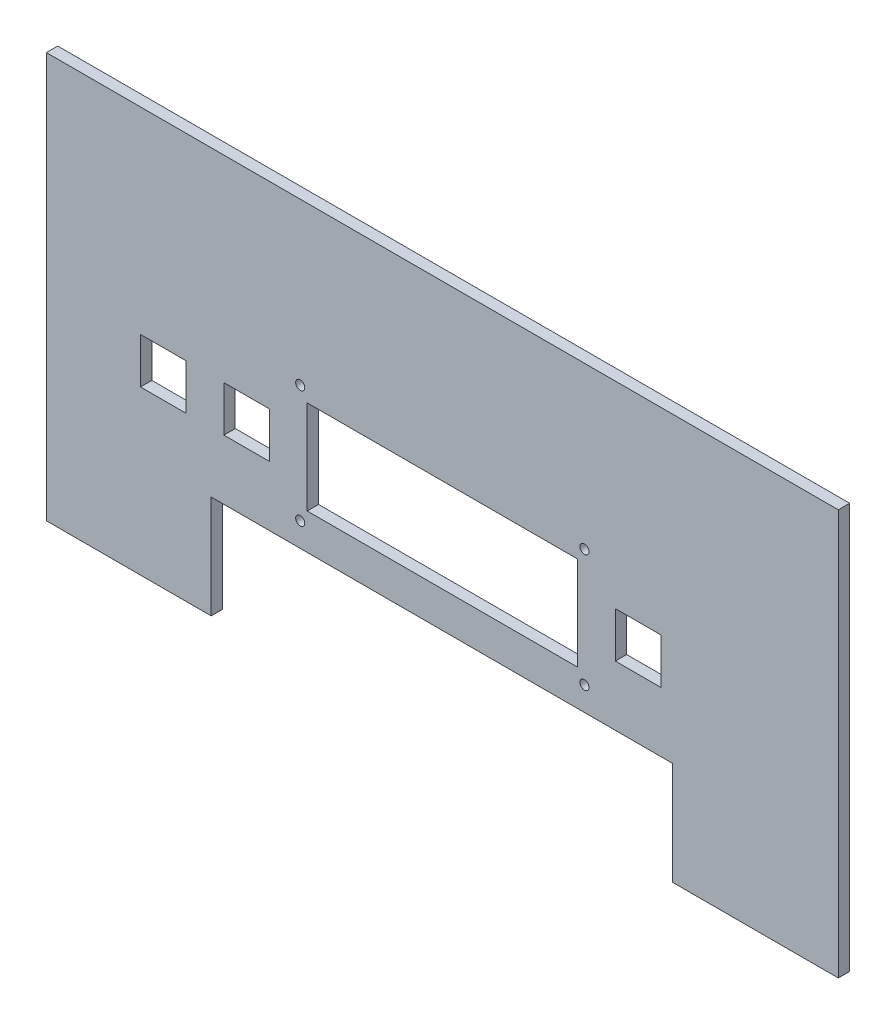
ISO-10303-21;
HEADER;
FILE_DESCRIPTION(('STEP AP214'),'2;1');
FILE_NAME('part.step','',(''),(''),'','','');
FILE_SCHEMA(('AUTOMOTIVE_DESIGN { 1 0 10303 214 1 1 1 1 }'));
ENDSEC;
DATA;
#1=APPLICATION_CONTEXT('core data for automotive mechanical design processes');
#2=APPLICATION_PROTOCOL_DEFINITION('international standard','automotive_design',2000,#1);
#3=PRODUCT_CONTEXT('',#1,'mechanical');
#4=PRODUCT('Part','Part','',(#3));
#5=PRODUCT_RELATED_PRODUCT_CATEGORY('part','',(#4));
#6=PRODUCT_DEFINITION_FORMATION('','',#4);
#7=PRODUCT_DEFINITION_CONTEXT('part definition',#1,'design');
#8=PRODUCT_DEFINITION('design','',#6,#7);
#9=PRODUCT_DEFINITION_SHAPE('','',#8);
#10=(LENGTH_UNIT() NAMED_UNIT(*) SI_UNIT(.MILLI.,.METRE.));
#11=(NAMED_UNIT(*) PLANE_ANGLE_UNIT() SI_UNIT($,.RADIAN.));
#12=(NAMED_UNIT(*) SI_UNIT($,.STERADIAN.) SOLID_ANGLE_UNIT());
#13=UNCERTAINTY_MEASURE_WITH_UNIT(LENGTH_MEASURE(1.E-05),#10,'distance_accuracy_value','');
#14=(GEOMETRIC_REPRESENTATION_CONTEXT(3) GLOBAL_UNCERTAINTY_ASSIGNED_CONTEXT((#13)) GLOBAL_UNIT_ASSIGNED_CONTEXT((#10,
#11,#12)) REPRESENTATION_CONTEXT('',''));
#15=CARTESIAN_POINT('',(0.,0.,0.));
#16=DIRECTION('',(0.,0.,1.));
#17=DIRECTION('',(1.,0.,0.));
#18=AXIS2_PLACEMENT_3D('',#15,#16,#17);
#19=CARTESIAN_POINT('',(-104.5,-53.5,3.));
#20=DIRECTION('',(0.,1.,0.));
#21=DIRECTION('',(0.,0.,1.));
#22=AXIS2_PLACEMENT_3D('',#19,#20,#21);
#23=PLANE('',#22);
#24=DIRECTION('',(1.,0.,0.));
#25=VECTOR('',#24,1.);
#26=CARTESIAN_POINT('',(-104.5,-53.5,0.));
#27=LINE('',#26,#25);
#28=CARTESIAN_POINT('',(-104.5,-53.5,0.));
#29=VERTEX_POINT('',#28);
#30=CARTESIAN_POINT('',(-60.9999999999999,-53.5,0.));
#31=VERTEX_POINT('',#30);
#32=EDGE_CURVE('E387',#29,#31,#27,.T.);
#33=ORIENTED_EDGE('',*,*,#32,.T.);
#34=DIRECTION('',(0.,0.,1.));
#35=VECTOR('',#34,1.);
#36=CARTESIAN_POINT('',(-60.9999999999999,-53.5,0.));
#37=LINE('',#36,#35);
#38=CARTESIAN_POINT('',(-60.9999999999999,-53.5,3.));
#39=VERTEX_POINT('',#38);
#40=EDGE_CURVE('E312',#31,#39,#37,.T.);
#41=ORIENTED_EDGE('',*,*,#40,.T.);
#42=DIRECTION('',(1.,0.,0.));
#43=VECTOR('',#42,1.);
#44=CARTESIAN_POINT('',(-104.5,-53.5,3.));
#45=LINE('',#44,#43);
#46=CARTESIAN_POINT('',(-104.5,-53.5,3.));
#47=VERTEX_POINT('',#46);
#48=EDGE_CURVE('E392',#47,#39,#45,.T.);
#49=ORIENTED_EDGE('',*,*,#48,.F.);
#50=DIRECTION('',(0.,0.,-1.));
#51=VECTOR('',#50,1.);
#52=CARTESIAN_POINT('',(-104.5,-53.5,3.));
#53=LINE('',#52,#51);
#54=EDGE_CURVE('E407',#47,#29,#53,.T.);
#55=ORIENTED_EDGE('',*,*,#54,.T.);
#56=EDGE_LOOP('',(#33,#41,#49,#55));
#57=FACE_BOUND('',#56,.T.);
#58=ADVANCED_FACE('F43',(#57),#23,.F.);
#59=CARTESIAN_POINT('',(0.,0.,3.));
#60=DIRECTION('',(0.,0.,-1.));
#61=DIRECTION('',(-1.,0.,0.));
#62=AXIS2_PLACEMENT_3D('',#59,#60,#61);
#63=PLANE('',#62);
#64=DIRECTION('',(-1.,0.,0.));
#65=VECTOR('',#64,1.);
#66=CARTESIAN_POINT('',(45.65,1.5,3.));
#67=LINE('',#66,#65);
#68=CARTESIAN_POINT('',(57.65,1.5,3.));
#69=VERTEX_POINT('',#68);
#70=CARTESIAN_POINT('',(45.65,1.5,3.));
#71=VERTEX_POINT('',#70);
#72=EDGE_CURVE('E258',#69,#71,#67,.T.);
#73=ORIENTED_EDGE('',*,*,#72,.F.);
#74=DIRECTION('',(0.,1.,0.));
#75=VECTOR('',#74,1.);
#76=CARTESIAN_POINT('',(57.65,-10.5,3.));
#77=LINE('',#76,#75);
#78=CARTESIAN_POINT('',(57.65,-10.5,3.));
#79=VERTEX_POINT('',#78);
#80=EDGE_CURVE('E58',#79,#69,#77,.T.);
#81=ORIENTED_EDGE('',*,*,#80,.F.);
#82=DIRECTION('',(1.,0.,0.));
#83=VECTOR('',#82,1.);
#84=CARTESIAN_POINT('',(45.65,-10.5,3.));
#85=LINE('',#84,#83);
#86=CARTESIAN_POINT('',(45.65,-10.5,3.));
#87=VERTEX_POINT('',#86);
#88=EDGE_CURVE('E251',#87,#79,#85,.T.);
#89=ORIENTED_EDGE('',*,*,#88,.F.);
#90=DIRECTION('',(0.,-1.,0.));
#91=VECTOR('',#90,1.);
#92=CARTESIAN_POINT('',(45.65,-10.5,3.));
#93=LINE('',#92,#91);
#94=EDGE_CURVE('E254',#71,#87,#93,.T.);
#95=ORIENTED_EDGE('',*,*,#94,.F.);
#96=EDGE_LOOP('',(#73,#81,#89,#95));
#97=FACE_BOUND('',#96,.T.);
#98=DIRECTION('',(-1.,0.,0.));
#99=VECTOR('',#98,1.);
#100=CARTESIAN_POINT('',(-79.65,1.5,3.));
#101=LINE('',#100,#99);
#102=CARTESIAN_POINT('',(-67.65,1.5,3.));
#103=VERTEX_POINT('',#102);
#104=CARTESIAN_POINT('',(-79.65,1.5,3.));
#105=VERTEX_POINT('',#104);
#106=EDGE_CURVE('E224',#103,#105,#101,.T.);
#107=ORIENTED_EDGE('',*,*,#106,.F.);
#108=DIRECTION('',(0.,1.,0.));
#109=VECTOR('',#108,1.);
#110=CARTESIAN_POINT('',(-67.65,-10.5,3.));
#111=LINE('',#110,#109);
#112=CARTESIAN_POINT('',(-67.65,-10.5,3.));
#113=VERTEX_POINT('',#112);
#114=EDGE_CURVE('E66',#113,#103,#111,.T.);
#115=ORIENTED_EDGE('',*,*,#114,.F.);
#116=DIRECTION('',(1.,0.,0.));
#117=VECTOR('',#116,1.);
#118=CARTESIAN_POINT('',(-79.65,-10.5,3.));
#119=LINE('',#118,#117);
#120=CARTESIAN_POINT('',(-79.65,-10.5,3.));
#121=VERTEX_POINT('',#120);
#122=EDGE_CURVE('E213',#121,#113,#119,.T.);
#123=ORIENTED_EDGE('',*,*,#122,.F.);
#124=DIRECTION('',(0.,-1.,0.));
#125=VECTOR('',#124,1.);
#126=CARTESIAN_POINT('',(-79.65,-10.5,3.));
#127=LINE('',#126,#125);
#128=EDGE_CURVE('E218',#105,#121,#127,.T.);
#129=ORIENTED_EDGE('',*,*,#128,.F.);
#130=EDGE_LOOP('',(#107,#115,#123,#129));
#131=FACE_BOUND('',#130,.T.);
#132=DIRECTION('',(-1.,0.,0.));
#133=VECTOR('',#132,1.);
#134=CARTESIAN_POINT('',(-57.65,1.5,3.));
#135=LINE('',#134,#133);
#136=CARTESIAN_POINT('',(-45.65,1.5,3.));
#137=VERTEX_POINT('',#136);
#138=CARTESIAN_POINT('',(-57.65,1.5,3.));
#139=VERTEX_POINT('',#138);
#140=EDGE_CURVE('E227',#137,#139,#135,.T.);
#141=ORIENTED_EDGE('',*,*,#140,.F.);
#142=DIRECTION('',(0.,1.,0.));
#143=VECTOR('',#142,1.);
#144=CARTESIAN_POINT('',(-45.65,-10.5,3.));
#145=LINE('',#144,#143);
#146=CARTESIAN_POINT('',(-45.65,-10.5,3.));
#147=VERTEX_POINT('',#146);
#148=EDGE_CURVE('E225',#147,#137,#145,.T.);
#149=ORIENTED_EDGE('',*,*,#148,.F.);
#150=DIRECTION('',(1.,0.,0.));
#151=VECTOR('',#150,1.);
#152=CARTESIAN_POINT('',(-57.65,-10.5,3.));
#153=LINE('',#152,#151);
#154=CARTESIAN_POINT('',(-57.65,-10.5,3.));
#155=VERTEX_POINT('',#154);
#156=EDGE_CURVE('E276',#155,#147,#153,.T.);
#157=ORIENTED_EDGE('',*,*,#156,.F.);
#158=DIRECTION('',(0.,-1.,0.));
#159=VECTOR('',#158,1.);
#160=CARTESIAN_POINT('',(-57.65,-10.5,3.));
#161=LINE('',#160,#159);
#162=EDGE_CURVE('E288',#139,#155,#161,.T.);
#163=ORIENTED_EDGE('',*,*,#162,.F.);
#164=EDGE_LOOP('',(#141,#149,#157,#163));
#165=FACE_BOUND('',#164,.T.);
#166=ORIENTED_EDGE('',*,*,#48,.T.);
#167=DIRECTION('',(0.,-1.,0.));
#168=VECTOR('',#167,1.);
#169=CARTESIAN_POINT('',(-61.0000000000004,-26.3199999999999,3.));
#170=LINE('',#169,#168);
#171=CARTESIAN_POINT('',(-61.0000000000004,-26.3199999999999,3.));
#172=VERTEX_POINT('',#171);
#173=EDGE_CURVE('E295',#172,#39,#170,.T.);
#174=ORIENTED_EDGE('',*,*,#173,.F.);
#175=DIRECTION('',(-1.,0.,0.));
#176=VECTOR('',#175,1.);
#177=CARTESIAN_POINT('',(-61.0000000000004,-26.3199999999999,3.));
#178=LINE('',#177,#176);
#179=CARTESIAN_POINT('',(60.7047396104666,-26.3199999999999,3.));
#180=VERTEX_POINT('',#179);
#181=EDGE_CURVE('E306',#180,#172,#178,.T.);
#182=ORIENTED_EDGE('',*,*,#181,.F.);
#183=DIRECTION('',(0.,1.,0.));
#184=VECTOR('',#183,1.);
#185=CARTESIAN_POINT('',(60.7047396104666,-26.3199999999999,3.));
#186=LINE('',#185,#184);
#187=CARTESIAN_POINT('',(60.7047396104666,-53.5,3.));
#188=VERTEX_POINT('',#187);
#189=EDGE_CURVE('E314',#188,#180,#186,.T.);
#190=ORIENTED_EDGE('',*,*,#189,.F.);
#191=CARTESIAN_POINT('',(104.5,-53.5,3.));
#192=VERTEX_POINT('',#191);
#193=EDGE_CURVE('E391',#188,#192,#45,.T.);
#194=ORIENTED_EDGE('',*,*,#193,.T.);
#195=DIRECTION('',(0.,1.,0.));
#196=VECTOR('',#195,1.);
#197=CARTESIAN_POINT('',(104.5,-53.5,3.));
#198=LINE('',#197,#196);
#199=CARTESIAN_POINT('',(104.5,53.5,3.));
#200=VERTEX_POINT('',#199);
#201=EDGE_CURVE('E383',#192,#200,#198,.T.);
#202=ORIENTED_EDGE('',*,*,#201,.T.);
#203=DIRECTION('',(-1.,0.,0.));
#204=VECTOR('',#203,1.);
#205=CARTESIAN_POINT('',(-104.5,53.5,3.));
#206=LINE('',#205,#204);
#207=CARTESIAN_POINT('',(-104.5,53.5,3.));
#208=VERTEX_POINT('',#207);
#209=EDGE_CURVE('E386',#200,#208,#206,.T.);
#210=ORIENTED_EDGE('',*,*,#209,.T.);
#211=DIRECTION('',(0.,-1.,0.));
#212=VECTOR('',#211,1.);
#213=CARTESIAN_POINT('',(-104.5,-53.5,3.));
#214=LINE('',#213,#212);
#215=EDGE_CURVE('E389',#208,#47,#214,.T.);
#216=ORIENTED_EDGE('',*,*,#215,.T.);
#217=EDGE_LOOP('',(#166,#174,#182,#190,#194,#202,#210,#216));
#218=FACE_BOUND('',#217,.T.);
#219=DIRECTION('',(0.,-1.,0.));
#220=VECTOR('',#219,1.);
#221=CARTESIAN_POINT('',(-35.65,7.85,3.));
#222=LINE('',#221,#220);
#223=CARTESIAN_POINT('',(-35.65,7.85,3.));
#224=VERTEX_POINT('',#223);
#225=CARTESIAN_POINT('',(-35.65,-16.85,3.));
#226=VERTEX_POINT('',#225);
#227=EDGE_CURVE('E352',#224,#226,#222,.T.);
#228=ORIENTED_EDGE('',*,*,#227,.F.);
#229=DIRECTION('',(-1.,0.,0.));
#230=VECTOR('',#229,1.);
#231=CARTESIAN_POINT('',(-35.65,7.85,3.));
#232=LINE('',#231,#230);
#233=CARTESIAN_POINT('',(35.65,7.85,3.));
#234=VERTEX_POINT('',#233);
#235=EDGE_CURVE('E360',#234,#224,#232,.T.);
#236=ORIENTED_EDGE('',*,*,#235,.F.);
#237=DIRECTION('',(0.,1.,0.));
#238=VECTOR('',#237,1.);
#239=CARTESIAN_POINT('',(35.65,7.85,3.));
#240=LINE('',#239,#238);
#241=CARTESIAN_POINT('',(35.65,-16.85,3.));
#242=VERTEX_POINT('',#241);
#243=EDGE_CURVE('E357',#242,#234,#240,.T.);
#244=ORIENTED_EDGE('',*,*,#243,.F.);
#245=DIRECTION('',(1.,0.,0.));
#246=VECTOR('',#245,1.);
#247=CARTESIAN_POINT('',(-35.65,-16.85,3.));
#248=LINE('',#247,#246);
#249=EDGE_CURVE('E354',#226,#242,#248,.T.);
#250=ORIENTED_EDGE('',*,*,#249,.F.);
#251=EDGE_LOOP('',(#228,#236,#244,#250));
#252=FACE_BOUND('',#251,.T.);
#253=CARTESIAN_POINT('',(-37.5,11.,3.));
#254=DIRECTION('',(0.,0.,1.));
#255=DIRECTION('',(1.,0.,0.));
#256=AXIS2_PLACEMENT_3D('',#253,#254,#255);
#257=CIRCLE('',#256,1.2);
#258=CARTESIAN_POINT('',(-36.3,11.,3.));
#259=VERTEX_POINT('',#258);
#260=EDGE_CURVE('E346',#259,#259,#257,.T.);
#261=ORIENTED_EDGE('',*,*,#260,.F.);
#262=EDGE_LOOP('',(#261));
#263=FACE_BOUND('',#262,.T.);
#264=CARTESIAN_POINT('',(37.5,11.,3.));
#265=DIRECTION('',(0.,0.,1.));
#266=DIRECTION('',(-1.,0.,0.));
#267=AXIS2_PLACEMENT_3D('',#264,#265,#266);
#268=CIRCLE('',#267,1.2);
#269=CARTESIAN_POINT('',(36.3,11.,3.));
#270=VERTEX_POINT('',#269);
#271=EDGE_CURVE('E340',#270,#270,#268,.T.);
#272=ORIENTED_EDGE('',*,*,#271,.F.);
#273=EDGE_LOOP('',(#272));
#274=FACE_BOUND('',#273,.T.);
#275=CARTESIAN_POINT('',(37.5,-20.,3.));
#276=DIRECTION('',(0.,0.,1.));
#277=DIRECTION('',(1.,0.,0.));
#278=AXIS2_PLACEMENT_3D('',#275,#276,#277);
#279=CIRCLE('',#278,1.2);
#280=CARTESIAN_POINT('',(38.7,-20.,3.));
#281=VERTEX_POINT('',#280);
#282=EDGE_CURVE('E334',#281,#281,#279,.T.);
#283=ORIENTED_EDGE('',*,*,#282,.F.);
#284=EDGE_LOOP('',(#283));
#285=FACE_BOUND('',#284,.T.);
#286=CARTESIAN_POINT('',(-37.5,-20.,3.));
#287=DIRECTION('',(0.,0.,1.));
#288=DIRECTION('',(-1.,0.,0.));
#289=AXIS2_PLACEMENT_3D('',#286,#287,#288);
#290=CIRCLE('',#289,1.2);
#291=CARTESIAN_POINT('',(-38.7,-20.,3.));
#292=VERTEX_POINT('',#291);
#293=EDGE_CURVE('E328',#292,#292,#290,.T.);
#294=ORIENTED_EDGE('',*,*,#293,.F.);
#295=EDGE_LOOP('',(#294));
#296=FACE_BOUND('',#295,.T.);
#297=ADVANCED_FACE('F221',(#97,#131,#165,#218,#252,#263,#274,#285,#296),#63,.F.);
#298=CARTESIAN_POINT('',(0.,0.,0.));
#299=DIRECTION('',(0.,0.,-1.));
#300=DIRECTION('',(-1.,0.,0.));
#301=AXIS2_PLACEMENT_3D('',#298,#299,#300);
#302=PLANE('',#301);
#303=DIRECTION('',(0.,1.,0.));
#304=VECTOR('',#303,1.);
#305=CARTESIAN_POINT('',(57.65,-10.5,0.));
#306=LINE('',#305,#304);
#307=CARTESIAN_POINT('',(57.65,-10.5,0.));
#308=VERTEX_POINT('',#307);
#309=CARTESIAN_POINT('',(57.65,1.5,0.));
#310=VERTEX_POINT('',#309);
#311=EDGE_CURVE('E255',#308,#310,#306,.T.);
#312=ORIENTED_EDGE('',*,*,#311,.T.);
#313=DIRECTION('',(-1.,0.,0.));
#314=VECTOR('',#313,1.);
#315=CARTESIAN_POINT('',(45.65,1.5,0.));
#316=LINE('',#315,#314);
#317=CARTESIAN_POINT('',(45.65,1.5,0.));
#318=VERTEX_POINT('',#317);
#319=EDGE_CURVE('E267',#310,#318,#316,.T.);
#320=ORIENTED_EDGE('',*,*,#319,.T.);
#321=DIRECTION('',(0.,-1.,0.));
#322=VECTOR('',#321,1.);
#323=CARTESIAN_POINT('',(45.65,-10.5,0.));
#324=LINE('',#323,#322);
#325=CARTESIAN_POINT('',(45.65,-10.5,0.));
#326=VERTEX_POINT('',#325);
#327=EDGE_CURVE('E264',#318,#326,#324,.T.);
#328=ORIENTED_EDGE('',*,*,#327,.T.);
#329=DIRECTION('',(1.,0.,0.));
#330=VECTOR('',#329,1.);
#331=CARTESIAN_POINT('',(45.65,-10.5,0.));
#332=LINE('',#331,#330);
#333=EDGE_CURVE('E244',#326,#308,#332,.T.);
#334=ORIENTED_EDGE('',*,*,#333,.T.);
#335=EDGE_LOOP('',(#312,#320,#328,#334));
#336=FACE_BOUND('',#335,.T.);
#337=DIRECTION('',(0.,1.,0.));
#338=VECTOR('',#337,1.);
#339=CARTESIAN_POINT('',(-67.65,-10.5,0.));
#340=LINE('',#339,#338);
#341=CARTESIAN_POINT('',(-67.65,-10.5,0.));
#342=VERTEX_POINT('',#341);
#343=CARTESIAN_POINT('',(-67.65,1.5,0.));
#344=VERTEX_POINT('',#343);
#345=EDGE_CURVE('E206',#342,#344,#340,.T.);
#346=ORIENTED_EDGE('',*,*,#345,.T.);
#347=DIRECTION('',(-1.,0.,0.));
#348=VECTOR('',#347,1.);
#349=CARTESIAN_POINT('',(-79.65,1.5,0.));
#350=LINE('',#349,#348);
#351=CARTESIAN_POINT('',(-79.65,1.5,0.));
#352=VERTEX_POINT('',#351);
#353=EDGE_CURVE('E238',#344,#352,#350,.T.);
#354=ORIENTED_EDGE('',*,*,#353,.T.);
#355=DIRECTION('',(0.,-1.,0.));
#356=VECTOR('',#355,1.);
#357=CARTESIAN_POINT('',(-79.65,-10.5,0.));
#358=LINE('',#357,#356);
#359=CARTESIAN_POINT('',(-79.65,-10.5,0.));
#360=VERTEX_POINT('',#359);
#361=EDGE_CURVE('E234',#352,#360,#358,.T.);
#362=ORIENTED_EDGE('',*,*,#361,.T.);
#363=DIRECTION('',(1.,0.,0.));
#364=VECTOR('',#363,1.);
#365=CARTESIAN_POINT('',(-79.65,-10.5,0.));
#366=LINE('',#365,#364);
#367=EDGE_CURVE('E232',#360,#342,#366,.T.);
#368=ORIENTED_EDGE('',*,*,#367,.T.);
#369=EDGE_LOOP('',(#346,#354,#362,#368));
#370=FACE_BOUND('',#369,.T.);
#371=DIRECTION('',(0.,1.,0.));
#372=VECTOR('',#371,1.);
#373=CARTESIAN_POINT('',(-45.65,-10.5,0.));
#374=LINE('',#373,#372);
#375=CARTESIAN_POINT('',(-45.65,-10.5,0.));
#376=VERTEX_POINT('',#375);
#377=CARTESIAN_POINT('',(-45.65,1.5,0.));
#378=VERTEX_POINT('',#377);
#379=EDGE_CURVE('E272',#376,#378,#374,.T.);
#380=ORIENTED_EDGE('',*,*,#379,.T.);
#381=DIRECTION('',(-1.,0.,0.));
#382=VECTOR('',#381,1.);
#383=CARTESIAN_POINT('',(-57.65,1.5,0.));
#384=LINE('',#383,#382);
#385=CARTESIAN_POINT('',(-57.65,1.5,0.));
#386=VERTEX_POINT('',#385);
#387=EDGE_CURVE('E275',#378,#386,#384,.T.);
#388=ORIENTED_EDGE('',*,*,#387,.T.);
#389=DIRECTION('',(0.,-1.,0.));
#390=VECTOR('',#389,1.);
#391=CARTESIAN_POINT('',(-57.65,-10.5,0.));
#392=LINE('',#391,#390);
#393=CARTESIAN_POINT('',(-57.65,-10.5,0.));
#394=VERTEX_POINT('',#393);
#395=EDGE_CURVE('E279',#386,#394,#392,.T.);
#396=ORIENTED_EDGE('',*,*,#395,.T.);
#397=DIRECTION('',(1.,0.,0.));
#398=VECTOR('',#397,1.);
#399=CARTESIAN_POINT('',(-57.65,-10.5,0.));
#400=LINE('',#399,#398);
#401=EDGE_CURVE('E282',#394,#376,#400,.T.);
#402=ORIENTED_EDGE('',*,*,#401,.T.);
#403=EDGE_LOOP('',(#380,#388,#396,#402));
#404=FACE_BOUND('',#403,.T.);
#405=DIRECTION('',(0.,-1.,0.));
#406=VECTOR('',#405,1.);
#407=CARTESIAN_POINT('',(-61.0000000000004,-26.3199999999999,0.));
#408=LINE('',#407,#406);
#409=CARTESIAN_POINT('',(-61.0000000000004,-26.3199999999999,0.));
#410=VERTEX_POINT('',#409);
#411=EDGE_CURVE('E302',#410,#31,#408,.T.);
#412=ORIENTED_EDGE('',*,*,#411,.T.);
#413=ORIENTED_EDGE('',*,*,#32,.F.);
#414=DIRECTION('',(0.,-1.,0.));
#415=VECTOR('',#414,1.);
#416=CARTESIAN_POINT('',(-104.5,-53.5,0.));
#417=LINE('',#416,#415);
#418=CARTESIAN_POINT('',(-104.5,53.5,0.));
#419=VERTEX_POINT('',#418);
#420=EDGE_CURVE('E400',#419,#29,#417,.T.);
#421=ORIENTED_EDGE('',*,*,#420,.F.);
#422=DIRECTION('',(-1.,0.,0.));
#423=VECTOR('',#422,1.);
#424=CARTESIAN_POINT('',(-104.5,53.5,0.));
#425=LINE('',#424,#423);
#426=CARTESIAN_POINT('',(104.5,53.5,0.));
#427=VERTEX_POINT('',#426);
#428=EDGE_CURVE('E398',#427,#419,#425,.T.);
#429=ORIENTED_EDGE('',*,*,#428,.F.);
#430=DIRECTION('',(0.,1.,0.));
#431=VECTOR('',#430,1.);
#432=CARTESIAN_POINT('',(104.5,-53.5,0.));
#433=LINE('',#432,#431);
#434=CARTESIAN_POINT('',(104.5,-53.5,0.));
#435=VERTEX_POINT('',#434);
#436=EDGE_CURVE('E382',#435,#427,#433,.T.);
#437=ORIENTED_EDGE('',*,*,#436,.F.);
#438=CARTESIAN_POINT('',(60.7047396104666,-53.5,0.));
#439=VERTEX_POINT('',#438);
#440=EDGE_CURVE('E402',#439,#435,#27,.T.);
#441=ORIENTED_EDGE('',*,*,#440,.F.);
#442=DIRECTION('',(0.,1.,0.));
#443=VECTOR('',#442,1.);
#444=CARTESIAN_POINT('',(60.7047396104666,-26.3199999999999,0.));
#445=LINE('',#444,#443);
#446=CARTESIAN_POINT('',(60.7047396104666,-26.3199999999999,0.));
#447=VERTEX_POINT('',#446);
#448=EDGE_CURVE('E305',#439,#447,#445,.T.);
#449=ORIENTED_EDGE('',*,*,#448,.T.);
#450=DIRECTION('',(-1.,0.,0.));
#451=VECTOR('',#450,1.);
#452=CARTESIAN_POINT('',(-61.0000000000004,-26.3199999999999,0.));
#453=LINE('',#452,#451);
#454=EDGE_CURVE('E309',#447,#410,#453,.T.);
#455=ORIENTED_EDGE('',*,*,#454,.T.);
#456=EDGE_LOOP('',(#412,#413,#421,#429,#437,#441,#449,#455));
#457=FACE_BOUND('',#456,.T.);
#458=CARTESIAN_POINT('',(37.5,-20.,0.));
#459=DIRECTION('',(0.,0.,1.));
#460=DIRECTION('',(1.,0.,0.));
#461=AXIS2_PLACEMENT_3D('',#458,#459,#460);
#462=CIRCLE('',#461,1.2);
#463=CARTESIAN_POINT('',(38.7,-20.,0.));
#464=VERTEX_POINT('',#463);
#465=EDGE_CURVE('E331',#464,#464,#462,.T.);
#466=ORIENTED_EDGE('',*,*,#465,.T.);
#467=EDGE_LOOP('',(#466));
#468=FACE_BOUND('',#467,.T.);
#469=CARTESIAN_POINT('',(-37.5,11.,0.));
#470=DIRECTION('',(0.,0.,1.));
#471=DIRECTION('',(1.,0.,0.));
#472=AXIS2_PLACEMENT_3D('',#469,#470,#471);
#473=CIRCLE('',#472,1.2);
#474=CARTESIAN_POINT('',(-36.3,11.,0.));
#475=VERTEX_POINT('',#474);
#476=EDGE_CURVE('E343',#475,#475,#473,.T.);
#477=ORIENTED_EDGE('',*,*,#476,.T.);
#478=EDGE_LOOP('',(#477));
#479=FACE_BOUND('',#478,.T.);
#480=DIRECTION('',(-1.,0.,0.));
#481=VECTOR('',#480,1.);
#482=CARTESIAN_POINT('',(-35.65,7.85,0.));
#483=LINE('',#482,#481);
#484=CARTESIAN_POINT('',(35.65,7.85,0.));
#485=VERTEX_POINT('',#484);
#486=CARTESIAN_POINT('',(-35.65,7.85,0.));
#487=VERTEX_POINT('',#486);
#488=EDGE_CURVE('E355',#485,#487,#483,.T.);
#489=ORIENTED_EDGE('',*,*,#488,.T.);
#490=DIRECTION('',(0.,-1.,0.));
#491=VECTOR('',#490,1.);
#492=CARTESIAN_POINT('',(-35.65,7.85,0.));
#493=LINE('',#492,#491);
#494=CARTESIAN_POINT('',(-35.65,-16.85,0.));
#495=VERTEX_POINT('',#494);
#496=EDGE_CURVE('E349',#487,#495,#493,.T.);
#497=ORIENTED_EDGE('',*,*,#496,.T.);
#498=DIRECTION('',(1.,0.,0.));
#499=VECTOR('',#498,1.);
#500=CARTESIAN_POINT('',(-35.65,-16.85,0.));
#501=LINE('',#500,#499);
#502=CARTESIAN_POINT('',(35.65,-16.85,0.));
#503=VERTEX_POINT('',#502);
#504=EDGE_CURVE('E365',#495,#503,#501,.T.);
#505=ORIENTED_EDGE('',*,*,#504,.T.);
#506=DIRECTION('',(0.,1.,0.));
#507=VECTOR('',#506,1.);
#508=CARTESIAN_POINT('',(35.65,7.85,0.));
#509=LINE('',#508,#507);
#510=EDGE_CURVE('E368',#503,#485,#509,.T.);
#511=ORIENTED_EDGE('',*,*,#510,.T.);
#512=EDGE_LOOP('',(#489,#497,#505,#511));
#513=FACE_BOUND('',#512,.T.);
#514=CARTESIAN_POINT('',(37.5,11.,0.));
#515=DIRECTION('',(0.,0.,1.));
#516=DIRECTION('',(-1.,0.,0.));
#517=AXIS2_PLACEMENT_3D('',#514,#515,#516);
#518=CIRCLE('',#517,1.2);
#519=CARTESIAN_POINT('',(36.3,11.,0.));
#520=VERTEX_POINT('',#519);
#521=EDGE_CURVE('E337',#520,#520,#518,.T.);
#522=ORIENTED_EDGE('',*,*,#521,.T.);
#523=EDGE_LOOP('',(#522));
#524=FACE_BOUND('',#523,.T.);
#525=CARTESIAN_POINT('',(-37.5,-20.,0.));
#526=DIRECTION('',(0.,0.,1.));
#527=DIRECTION('',(-1.,0.,0.));
#528=AXIS2_PLACEMENT_3D('',#525,#526,#527);
#529=CIRCLE('',#528,1.2);
#530=CARTESIAN_POINT('',(-38.7,-20.,0.));
#531=VERTEX_POINT('',#530);
#532=EDGE_CURVE('E321',#531,#531,#529,.T.);
#533=ORIENTED_EDGE('',*,*,#532,.T.);
#534=EDGE_LOOP('',(#533));
#535=FACE_BOUND('',#534,.T.);
#536=ADVANCED_FACE('F419',(#336,#370,#404,#457,#468,#479,#513,#524,#535),#302,.T.);
#537=CARTESIAN_POINT('',(104.5,-53.5,3.));
#538=DIRECTION('',(-1.,0.,0.));
#539=DIRECTION('',(0.,0.,1.));
#540=AXIS2_PLACEMENT_3D('',#537,#538,#539);
#541=PLANE('',#540);
#542=ORIENTED_EDGE('',*,*,#436,.T.);
#543=DIRECTION('',(0.,0.,-1.));
#544=VECTOR('',#543,1.);
#545=CARTESIAN_POINT('',(104.5,53.5,3.));
#546=LINE('',#545,#544);
#547=EDGE_CURVE('E11',#200,#427,#546,.T.);
#548=ORIENTED_EDGE('',*,*,#547,.F.);
#549=ORIENTED_EDGE('',*,*,#201,.F.);
#550=DIRECTION('',(0.,0.,-1.));
#551=VECTOR('',#550,1.);
#552=CARTESIAN_POINT('',(104.5,-53.5,3.));
#553=LINE('',#552,#551);
#554=EDGE_CURVE('E395',#192,#435,#553,.T.);
#555=ORIENTED_EDGE('',*,*,#554,.T.);
#556=EDGE_LOOP('',(#542,#548,#549,#555));
#557=FACE_BOUND('',#556,.T.);
#558=ADVANCED_FACE('F45',(#557),#541,.F.);
#559=CARTESIAN_POINT('',(-104.5,53.5,3.));
#560=DIRECTION('',(0.,-1.,0.));
#561=DIRECTION('',(1.,0.,0.));
#562=AXIS2_PLACEMENT_3D('',#559,#560,#561);
#563=PLANE('',#562);
#564=ORIENTED_EDGE('',*,*,#428,.T.);
#565=DIRECTION('',(0.,0.,-1.));
#566=VECTOR('',#565,1.);
#567=CARTESIAN_POINT('',(-104.5,53.5,3.));
#568=LINE('',#567,#566);
#569=EDGE_CURVE('E51',#208,#419,#568,.T.);
#570=ORIENTED_EDGE('',*,*,#569,.F.);
#571=ORIENTED_EDGE('',*,*,#209,.F.);
#572=ORIENTED_EDGE('',*,*,#547,.T.);
#573=EDGE_LOOP('',(#564,#570,#571,#572));
#574=FACE_BOUND('',#573,.T.);
#575=ADVANCED_FACE('F431',(#574),#563,.F.);
#576=CARTESIAN_POINT('',(-104.5,-53.5,3.));
#577=DIRECTION('',(1.,0.,0.));
#578=DIRECTION('',(0.,0.,-1.));
#579=AXIS2_PLACEMENT_3D('',#576,#577,#578);
#580=PLANE('',#579);
#581=ORIENTED_EDGE('',*,*,#420,.T.);
#582=ORIENTED_EDGE('',*,*,#54,.F.);
#583=ORIENTED_EDGE('',*,*,#215,.F.);
#584=ORIENTED_EDGE('',*,*,#569,.T.);
#585=EDGE_LOOP('',(#581,#582,#583,#584));
#586=FACE_BOUND('',#585,.T.);
#587=ADVANCED_FACE('F414',(#586),#580,.F.);
#588=ORIENTED_EDGE('',*,*,#193,.F.);
#589=DIRECTION('',(0.,0.,1.));
#590=VECTOR('',#589,1.);
#591=CARTESIAN_POINT('',(60.7047396104666,-53.5,0.));
#592=LINE('',#591,#590);
#593=EDGE_CURVE('E324',#439,#188,#592,.T.);
#594=ORIENTED_EDGE('',*,*,#593,.F.);
#595=ORIENTED_EDGE('',*,*,#440,.T.);
#596=ORIENTED_EDGE('',*,*,#554,.F.);
#597=EDGE_LOOP('',(#588,#594,#595,#596));
#598=FACE_BOUND('',#597,.T.);
#599=ADVANCED_FACE('F438',(#598),#23,.F.);
#600=CARTESIAN_POINT('',(-35.65,7.85,3.));
#601=DIRECTION('',(1.,0.,0.));
#602=DIRECTION('',(0.,0.,-1.));
#603=AXIS2_PLACEMENT_3D('',#600,#601,#602);
#604=PLANE('',#603);
#605=ORIENTED_EDGE('',*,*,#496,.F.);
#606=DIRECTION('',(0.,0.,-1.));
#607=VECTOR('',#606,1.);
#608=CARTESIAN_POINT('',(-35.65,7.85,3.));
#609=LINE('',#608,#607);
#610=EDGE_CURVE('E362',#224,#487,#609,.T.);
#611=ORIENTED_EDGE('',*,*,#610,.F.);
#612=ORIENTED_EDGE('',*,*,#227,.T.);
#613=DIRECTION('',(0.,0.,-1.));
#614=VECTOR('',#613,1.);
#615=CARTESIAN_POINT('',(-35.65,-16.85,3.));
#616=LINE('',#615,#614);
#617=EDGE_CURVE('E379',#226,#495,#616,.T.);
#618=ORIENTED_EDGE('',*,*,#617,.T.);
#619=EDGE_LOOP('',(#605,#611,#612,#618));
#620=FACE_BOUND('',#619,.T.);
#621=ADVANCED_FACE('F470',(#620),#604,.T.);
#622=CARTESIAN_POINT('',(-35.65,-16.85,3.));
#623=DIRECTION('',(0.,1.,0.));
#624=DIRECTION('',(0.,0.,1.));
#625=AXIS2_PLACEMENT_3D('',#622,#623,#624);
#626=PLANE('',#625);
#627=ORIENTED_EDGE('',*,*,#504,.F.);
#628=ORIENTED_EDGE('',*,*,#617,.F.);
#629=ORIENTED_EDGE('',*,*,#249,.T.);
#630=DIRECTION('',(0.,0.,-1.));
#631=VECTOR('',#630,1.);
#632=CARTESIAN_POINT('',(35.65,-16.85,3.));
#633=LINE('',#632,#631);
#634=EDGE_CURVE('E377',#242,#503,#633,.T.);
#635=ORIENTED_EDGE('',*,*,#634,.T.);
#636=EDGE_LOOP('',(#627,#628,#629,#635));
#637=FACE_BOUND('',#636,.T.);
#638=ADVANCED_FACE('F475',(#637),#626,.T.);
#639=CARTESIAN_POINT('',(35.65,7.85,3.));
#640=DIRECTION('',(-1.,0.,0.));
#641=DIRECTION('',(0.,0.,1.));
#642=AXIS2_PLACEMENT_3D('',#639,#640,#641);
#643=PLANE('',#642);
#644=ORIENTED_EDGE('',*,*,#510,.F.);
#645=ORIENTED_EDGE('',*,*,#634,.F.);
#646=ORIENTED_EDGE('',*,*,#243,.T.);
#647=DIRECTION('',(0.,0.,-1.));
#648=VECTOR('',#647,1.);
#649=CARTESIAN_POINT('',(35.65,7.85,3.));
#650=LINE('',#649,#648);
#651=EDGE_CURVE('E375',#234,#485,#650,.T.);
#652=ORIENTED_EDGE('',*,*,#651,.T.);
#653=EDGE_LOOP('',(#644,#645,#646,#652));
#654=FACE_BOUND('',#653,.T.);
#655=ADVANCED_FACE('F495',(#654),#643,.T.);
#656=CARTESIAN_POINT('',(-35.65,7.85,3.));
#657=DIRECTION('',(0.,-1.,0.));
#658=DIRECTION('',(0.,0.,-1.));
#659=AXIS2_PLACEMENT_3D('',#656,#657,#658);
#660=PLANE('',#659);
#661=ORIENTED_EDGE('',*,*,#488,.F.);
#662=ORIENTED_EDGE('',*,*,#651,.F.);
#663=ORIENTED_EDGE('',*,*,#235,.T.);
#664=ORIENTED_EDGE('',*,*,#610,.T.);
#665=EDGE_LOOP('',(#661,#662,#663,#664));
#666=FACE_BOUND('',#665,.T.);
#667=ADVANCED_FACE('F499',(#666),#660,.T.);
#668=CARTESIAN_POINT('',(-37.5,11.,3.));
#669=DIRECTION('',(0.,0.,-1.));
#670=DIRECTION('',(-1.,0.,0.));
#671=AXIS2_PLACEMENT_3D('',#668,#669,#670);
#672=CYLINDRICAL_SURFACE('',#671,1.2);
#673=ORIENTED_EDGE('',*,*,#260,.T.);
#674=EDGE_LOOP('',(#673));
#675=FACE_BOUND('',#674,.T.);
#676=ORIENTED_EDGE('',*,*,#476,.F.);
#677=EDGE_LOOP('',(#676));
#678=FACE_BOUND('',#677,.T.);
#679=ADVANCED_FACE('F503',(#675,#678),#672,.F.);
#680=CARTESIAN_POINT('',(37.5,11.,3.));
#681=DIRECTION('',(0.,0.,-1.));
#682=DIRECTION('',(-1.,0.,0.));
#683=AXIS2_PLACEMENT_3D('',#680,#681,#682);
#684=CYLINDRICAL_SURFACE('',#683,1.2);
#685=ORIENTED_EDGE('',*,*,#271,.T.);
#686=EDGE_LOOP('',(#685));
#687=FACE_BOUND('',#686,.T.);
#688=ORIENTED_EDGE('',*,*,#521,.F.);
#689=EDGE_LOOP('',(#688));
#690=FACE_BOUND('',#689,.T.);
#691=ADVANCED_FACE('F507',(#687,#690),#684,.F.);
#692=CARTESIAN_POINT('',(37.5,-20.,3.));
#693=DIRECTION('',(0.,0.,-1.));
#694=DIRECTION('',(-1.,0.,0.));
#695=AXIS2_PLACEMENT_3D('',#692,#693,#694);
#696=CYLINDRICAL_SURFACE('',#695,1.2);
#697=ORIENTED_EDGE('',*,*,#282,.T.);
#698=EDGE_LOOP('',(#697));
#699=FACE_BOUND('',#698,.T.);
#700=ORIENTED_EDGE('',*,*,#465,.F.);
#701=EDGE_LOOP('',(#700));
#702=FACE_BOUND('',#701,.T.);
#703=ADVANCED_FACE('F455',(#699,#702),#696,.F.);
#704=CARTESIAN_POINT('',(-37.5,-20.,3.));
#705=DIRECTION('',(0.,0.,-1.));
#706=DIRECTION('',(-1.,0.,0.));
#707=AXIS2_PLACEMENT_3D('',#704,#705,#706);
#708=CYLINDRICAL_SURFACE('',#707,1.2);
#709=ORIENTED_EDGE('',*,*,#293,.T.);
#710=EDGE_LOOP('',(#709));
#711=FACE_BOUND('',#710,.T.);
#712=ORIENTED_EDGE('',*,*,#532,.F.);
#713=EDGE_LOOP('',(#712));
#714=FACE_BOUND('',#713,.T.);
#715=ADVANCED_FACE('F448',(#711,#714),#708,.F.);
#716=CARTESIAN_POINT('',(-61.0000000000004,-26.3199999999999,0.));
#717=DIRECTION('',(-1.,0.,0.));
#718=DIRECTION('',(0.,-1.,0.));
#719=AXIS2_PLACEMENT_3D('',#716,#717,#718);
#720=PLANE('',#719);
#721=ORIENTED_EDGE('',*,*,#173,.T.);
#722=ORIENTED_EDGE('',*,*,#40,.F.);
#723=ORIENTED_EDGE('',*,*,#411,.F.);
#724=DIRECTION('',(0.,0.,1.));
#725=VECTOR('',#724,1.);
#726=CARTESIAN_POINT('',(-61.0000000000004,-26.3199999999999,0.));
#727=LINE('',#726,#725);
#728=EDGE_CURVE('E319',#410,#172,#727,.T.);
#729=ORIENTED_EDGE('',*,*,#728,.T.);
#730=EDGE_LOOP('',(#721,#722,#723,#729));
#731=FACE_BOUND('',#730,.T.);
#732=ADVANCED_FACE('F446',(#731),#720,.F.);
#733=CARTESIAN_POINT('',(-61.0000000000004,-26.3199999999999,0.));
#734=DIRECTION('',(0.,1.,0.));
#735=DIRECTION('',(0.,0.,1.));
#736=AXIS2_PLACEMENT_3D('',#733,#734,#735);
#737=PLANE('',#736);
#738=ORIENTED_EDGE('',*,*,#181,.T.);
#739=ORIENTED_EDGE('',*,*,#728,.F.);
#740=ORIENTED_EDGE('',*,*,#454,.F.);
#741=DIRECTION('',(0.,0.,1.));
#742=VECTOR('',#741,1.);
#743=CARTESIAN_POINT('',(60.7047396104666,-26.3199999999999,0.));
#744=LINE('',#743,#742);
#745=EDGE_CURVE('E322',#447,#180,#744,.T.);
#746=ORIENTED_EDGE('',*,*,#745,.T.);
#747=EDGE_LOOP('',(#738,#739,#740,#746));
#748=FACE_BOUND('',#747,.T.);
#749=ADVANCED_FACE('F443',(#748),#737,.F.);
#750=CARTESIAN_POINT('',(60.7047396104666,-26.3199999999999,0.));
#751=DIRECTION('',(1.,0.,0.));
#752=DIRECTION('',(0.,1.,0.));
#753=AXIS2_PLACEMENT_3D('',#750,#751,#752);
#754=PLANE('',#753);
#755=ORIENTED_EDGE('',*,*,#189,.T.);
#756=ORIENTED_EDGE('',*,*,#745,.F.);
#757=ORIENTED_EDGE('',*,*,#448,.F.);
#758=ORIENTED_EDGE('',*,*,#593,.T.);
#759=EDGE_LOOP('',(#755,#756,#757,#758));
#760=FACE_BOUND('',#759,.T.);
#761=ADVANCED_FACE('F441',(#760),#754,.F.);
#762=CARTESIAN_POINT('',(-45.65,-10.5,0.));
#763=DIRECTION('',(1.,0.,0.));
#764=DIRECTION('',(0.,0.,-1.));
#765=AXIS2_PLACEMENT_3D('',#762,#763,#764);
#766=PLANE('',#765);
#767=ORIENTED_EDGE('',*,*,#148,.T.);
#768=DIRECTION('',(0.,0.,1.));
#769=VECTOR('',#768,1.);
#770=CARTESIAN_POINT('',(-45.65,1.5,0.));
#771=LINE('',#770,#769);
#772=EDGE_CURVE('E284',#378,#137,#771,.T.);
#773=ORIENTED_EDGE('',*,*,#772,.F.);
#774=ORIENTED_EDGE('',*,*,#379,.F.);
#775=DIRECTION('',(0.,0.,1.));
#776=VECTOR('',#775,1.);
#777=CARTESIAN_POINT('',(-45.65,-10.5,0.));
#778=LINE('',#777,#776);
#779=EDGE_CURVE('E293',#376,#147,#778,.T.);
#780=ORIENTED_EDGE('',*,*,#779,.T.);
#781=EDGE_LOOP('',(#767,#773,#774,#780));
#782=FACE_BOUND('',#781,.T.);
#783=ADVANCED_FACE('F583',(#782),#766,.F.);
#784=CARTESIAN_POINT('',(-57.65,-10.5,0.));
#785=DIRECTION('',(0.,-1.,0.));
#786=DIRECTION('',(0.,0.,-1.));
#787=AXIS2_PLACEMENT_3D('',#784,#785,#786);
#788=PLANE('',#787);
#789=ORIENTED_EDGE('',*,*,#156,.T.);
#790=ORIENTED_EDGE('',*,*,#779,.F.);
#791=ORIENTED_EDGE('',*,*,#401,.F.);
#792=DIRECTION('',(0.,0.,1.));
#793=VECTOR('',#792,1.);
#794=CARTESIAN_POINT('',(-57.65,-10.5,0.));
#795=LINE('',#794,#793);
#796=EDGE_CURVE('E296',#394,#155,#795,.T.);
#797=ORIENTED_EDGE('',*,*,#796,.T.);
#798=EDGE_LOOP('',(#789,#790,#791,#797));
#799=FACE_BOUND('',#798,.T.);
#800=ADVANCED_FACE('F673',(#799),#788,.F.);
#801=CARTESIAN_POINT('',(-57.65,-10.5,0.));
#802=DIRECTION('',(-1.,0.,0.));
#803=DIRECTION('',(0.,0.,1.));
#804=AXIS2_PLACEMENT_3D('',#801,#802,#803);
#805=PLANE('',#804);
#806=ORIENTED_EDGE('',*,*,#162,.T.);
#807=ORIENTED_EDGE('',*,*,#796,.F.);
#808=ORIENTED_EDGE('',*,*,#395,.F.);
#809=DIRECTION('',(0.,0.,1.));
#810=VECTOR('',#809,1.);
#811=CARTESIAN_POINT('',(-57.65,1.5,0.));
#812=LINE('',#811,#810);
#813=EDGE_CURVE('E298',#386,#139,#812,.T.);
#814=ORIENTED_EDGE('',*,*,#813,.T.);
#815=EDGE_LOOP('',(#806,#807,#808,#814));
#816=FACE_BOUND('',#815,.T.);
#817=ADVANCED_FACE('F680',(#816),#805,.F.);
#818=CARTESIAN_POINT('',(-57.65,1.5,0.));
#819=DIRECTION('',(0.,1.,0.));
#820=DIRECTION('',(0.,0.,1.));
#821=AXIS2_PLACEMENT_3D('',#818,#819,#820);
#822=PLANE('',#821);
#823=ORIENTED_EDGE('',*,*,#140,.T.);
#824=ORIENTED_EDGE('',*,*,#813,.F.);
#825=ORIENTED_EDGE('',*,*,#387,.F.);
#826=ORIENTED_EDGE('',*,*,#772,.T.);
#827=EDGE_LOOP('',(#823,#824,#825,#826));
#828=FACE_BOUND('',#827,.T.);
#829=ADVANCED_FACE('F688',(#828),#822,.F.);
#830=CARTESIAN_POINT('',(-67.65,-10.5,0.));
#831=DIRECTION('',(1.,0.,0.));
#832=DIRECTION('',(0.,1.,0.));
#833=AXIS2_PLACEMENT_3D('',#830,#831,#832);
#834=PLANE('',#833);
#835=ORIENTED_EDGE('',*,*,#114,.T.);
#836=DIRECTION('',(0.,0.,1.));
#837=VECTOR('',#836,1.);
#838=CARTESIAN_POINT('',(-67.65,1.5,0.));
#839=LINE('',#838,#837);
#840=EDGE_CURVE('E235',#344,#103,#839,.T.);
#841=ORIENTED_EDGE('',*,*,#840,.F.);
#842=ORIENTED_EDGE('',*,*,#345,.F.);
#843=DIRECTION('',(0.,0.,1.));
#844=VECTOR('',#843,1.);
#845=CARTESIAN_POINT('',(-67.65,-10.5,0.));
#846=LINE('',#845,#844);
#847=EDGE_CURVE('E202',#342,#113,#846,.T.);
#848=ORIENTED_EDGE('',*,*,#847,.T.);
#849=EDGE_LOOP('',(#835,#841,#842,#848));
#850=FACE_BOUND('',#849,.T.);
#851=ADVANCED_FACE('F204',(#850),#834,.F.);
#852=CARTESIAN_POINT('',(-79.65,-10.5,0.));
#853=DIRECTION('',(0.,-1.,0.));
#854=DIRECTION('',(0.,0.,-1.));
#855=AXIS2_PLACEMENT_3D('',#852,#853,#854);
#856=PLANE('',#855);
#857=ORIENTED_EDGE('',*,*,#122,.T.);
#858=ORIENTED_EDGE('',*,*,#847,.F.);
#859=ORIENTED_EDGE('',*,*,#367,.F.);
#860=DIRECTION('',(0.,0.,1.));
#861=VECTOR('',#860,1.);
#862=CARTESIAN_POINT('',(-79.65,-10.5,0.));
#863=LINE('',#862,#861);
#864=EDGE_CURVE('E210',#360,#121,#863,.T.);
#865=ORIENTED_EDGE('',*,*,#864,.T.);
#866=EDGE_LOOP('',(#857,#858,#859,#865));
#867=FACE_BOUND('',#866,.T.);
#868=ADVANCED_FACE('F214',(#867),#856,.F.);
#869=CARTESIAN_POINT('',(-79.65,-10.5,0.));
#870=DIRECTION('',(-1.,0.,0.));
#871=DIRECTION('',(0.,0.,1.));
#872=AXIS2_PLACEMENT_3D('',#869,#870,#871);
#873=PLANE('',#872);
#874=ORIENTED_EDGE('',*,*,#128,.T.);
#875=ORIENTED_EDGE('',*,*,#864,.F.);
#876=ORIENTED_EDGE('',*,*,#361,.F.);
#877=DIRECTION('',(0.,0.,1.));
#878=VECTOR('',#877,1.);
#879=CARTESIAN_POINT('',(-79.65,1.5,0.));
#880=LINE('',#879,#878);
#881=EDGE_CURVE('E818',#352,#105,#880,.T.);
#882=ORIENTED_EDGE('',*,*,#881,.T.);
#883=EDGE_LOOP('',(#874,#875,#876,#882));
#884=FACE_BOUND('',#883,.T.);
#885=ADVANCED_FACE('F709',(#884),#873,.F.);
#886=CARTESIAN_POINT('',(-79.65,1.5,0.));
#887=DIRECTION('',(0.,1.,0.));
#888=DIRECTION('',(0.,0.,1.));
#889=AXIS2_PLACEMENT_3D('',#886,#887,#888);
#890=PLANE('',#889);
#891=ORIENTED_EDGE('',*,*,#106,.T.);
#892=ORIENTED_EDGE('',*,*,#881,.F.);
#893=ORIENTED_EDGE('',*,*,#353,.F.);
#894=ORIENTED_EDGE('',*,*,#840,.T.);
#895=EDGE_LOOP('',(#891,#892,#893,#894));
#896=FACE_BOUND('',#895,.T.);
#897=ADVANCED_FACE('F716',(#896),#890,.F.);
#898=CARTESIAN_POINT('',(57.65,-10.5,0.));
#899=DIRECTION('',(1.,0.,0.));
#900=DIRECTION('',(0.,0.,-1.));
#901=AXIS2_PLACEMENT_3D('',#898,#899,#900);
#902=PLANE('',#901);
#903=ORIENTED_EDGE('',*,*,#80,.T.);
#904=DIRECTION('',(0.,0.,1.));
#905=VECTOR('',#904,1.);
#906=CARTESIAN_POINT('',(57.65,1.5,0.));
#907=LINE('',#906,#905);
#908=EDGE_CURVE('E242',#310,#69,#907,.T.);
#909=ORIENTED_EDGE('',*,*,#908,.F.);
#910=ORIENTED_EDGE('',*,*,#311,.F.);
#911=DIRECTION('',(0.,0.,1.));
#912=VECTOR('',#911,1.);
#913=CARTESIAN_POINT('',(57.65,-10.5,0.));
#914=LINE('',#913,#912);
#915=EDGE_CURVE('E249',#308,#79,#914,.T.);
#916=ORIENTED_EDGE('',*,*,#915,.T.);
#917=EDGE_LOOP('',(#903,#909,#910,#916));
#918=FACE_BOUND('',#917,.T.);
#919=ADVANCED_FACE('F724',(#918),#902,.F.);
#920=CARTESIAN_POINT('',(45.65,-10.5,0.));
#921=DIRECTION('',(0.,-1.,0.));
#922=DIRECTION('',(0.,0.,-1.));
#923=AXIS2_PLACEMENT_3D('',#920,#921,#922);
#924=PLANE('',#923);
#925=ORIENTED_EDGE('',*,*,#88,.T.);
#926=ORIENTED_EDGE('',*,*,#915,.F.);
#927=ORIENTED_EDGE('',*,*,#333,.F.);
#928=DIRECTION('',(0.,0.,1.));
#929=VECTOR('',#928,1.);
#930=CARTESIAN_POINT('',(45.65,-10.5,0.));
#931=LINE('',#930,#929);
#932=EDGE_CURVE('E247',#326,#87,#931,.T.);
#933=ORIENTED_EDGE('',*,*,#932,.T.);
#934=EDGE_LOOP('',(#925,#926,#927,#933));
#935=FACE_BOUND('',#934,.T.);
#936=ADVANCED_FACE('F732',(#935),#924,.F.);
#937=CARTESIAN_POINT('',(45.65,-10.5,0.));
#938=DIRECTION('',(-1.,0.,0.));
#939=DIRECTION('',(0.,0.,1.));
#940=AXIS2_PLACEMENT_3D('',#937,#938,#939);
#941=PLANE('',#940);
#942=ORIENTED_EDGE('',*,*,#94,.T.);
#943=ORIENTED_EDGE('',*,*,#932,.F.);
#944=ORIENTED_EDGE('',*,*,#327,.F.);
#945=DIRECTION('',(0.,0.,1.));
#946=VECTOR('',#945,1.);
#947=CARTESIAN_POINT('',(45.65,1.5,0.));
#948=LINE('',#947,#946);
#949=EDGE_CURVE('E245',#318,#71,#948,.T.);
#950=ORIENTED_EDGE('',*,*,#949,.T.);
#951=EDGE_LOOP('',(#942,#943,#944,#950));
#952=FACE_BOUND('',#951,.T.);
#953=ADVANCED_FACE('F739',(#952),#941,.F.);
#954=CARTESIAN_POINT('',(45.65,1.5,0.));
#955=DIRECTION('',(0.,1.,0.));
#956=DIRECTION('',(0.,0.,1.));
#957=AXIS2_PLACEMENT_3D('',#954,#955,#956);
#958=PLANE('',#957);
#959=ORIENTED_EDGE('',*,*,#72,.T.);
#960=ORIENTED_EDGE('',*,*,#949,.F.);
#961=ORIENTED_EDGE('',*,*,#319,.F.);
#962=ORIENTED_EDGE('',*,*,#908,.T.);
#963=EDGE_LOOP('',(#959,#960,#961,#962));
#964=FACE_BOUND('',#963,.T.);
#965=ADVANCED_FACE('F747',(#964),#958,.F.);
#966=CLOSED_SHELL('',(#58,#297,#536,#558,#575,#587,#599,#621,#638,#655,#667,#679,#691,#703,#715,
#732,#749,#761,#783,#800,#817,#829,#851,#868,#885,#897,#919,#936,#953,#965));
#967=MANIFOLD_SOLID_BREP('B2',#966);
#968=ADVANCED_BREP_SHAPE_REPRESENTATION('',(#18,#967),#14);
#969=SHAPE_DEFINITION_REPRESENTATION(#9,#968);
ENDSEC;
END-ISO-10303-21;
